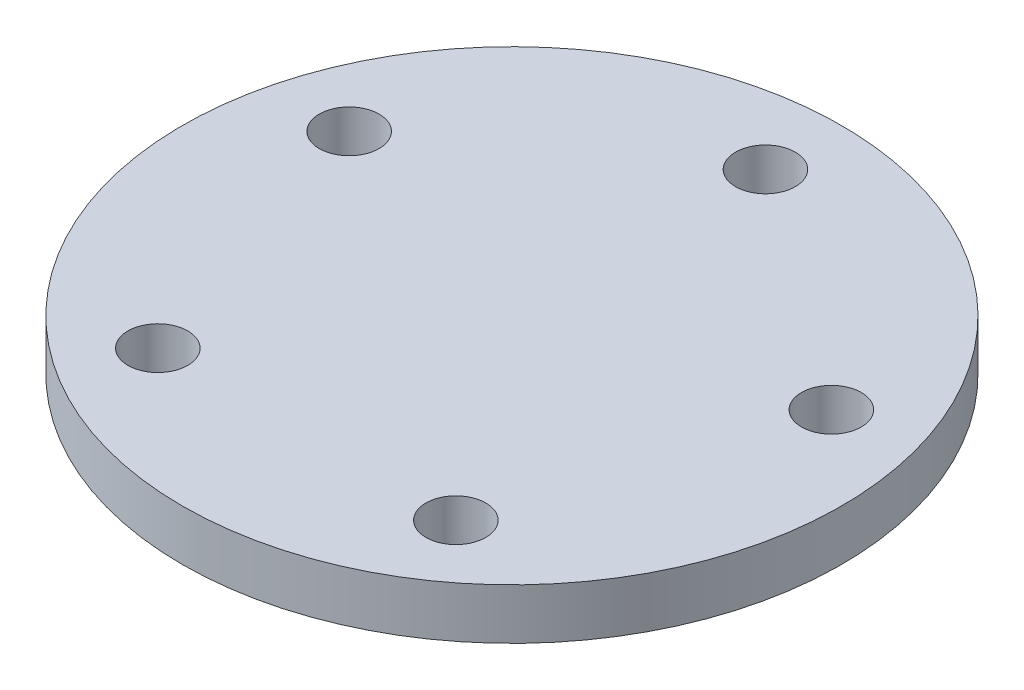
ISO-10303-21;
HEADER;
FILE_DESCRIPTION(('STEP AP214'),'2;1');
FILE_NAME('part.step','',(''),(''),'','','');
FILE_SCHEMA(('AUTOMOTIVE_DESIGN { 1 0 10303 214 1 1 1 1 }'));
ENDSEC;
DATA;
#1=APPLICATION_CONTEXT('core data for automotive mechanical design processes');
#2=APPLICATION_PROTOCOL_DEFINITION('international standard','automotive_design',2000,#1);
#3=PRODUCT_CONTEXT('',#1,'mechanical');
#4=PRODUCT('Part','Part','',(#3));
#5=PRODUCT_RELATED_PRODUCT_CATEGORY('part','',(#4));
#6=PRODUCT_DEFINITION_FORMATION('','',#4);
#7=PRODUCT_DEFINITION_CONTEXT('part definition',#1,'design');
#8=PRODUCT_DEFINITION('design','',#6,#7);
#9=PRODUCT_DEFINITION_SHAPE('','',#8);
#10=(LENGTH_UNIT() NAMED_UNIT(*) SI_UNIT(.MILLI.,.METRE.));
#11=(NAMED_UNIT(*) PLANE_ANGLE_UNIT() SI_UNIT($,.RADIAN.));
#12=(NAMED_UNIT(*) SI_UNIT($,.STERADIAN.) SOLID_ANGLE_UNIT());
#13=UNCERTAINTY_MEASURE_WITH_UNIT(LENGTH_MEASURE(1.E-05),#10,'distance_accuracy_value','');
#14=(GEOMETRIC_REPRESENTATION_CONTEXT(3) GLOBAL_UNCERTAINTY_ASSIGNED_CONTEXT((#13)) GLOBAL_UNIT_ASSIGNED_CONTEXT((#10,
#11,#12)) REPRESENTATION_CONTEXT('',''));
#15=CARTESIAN_POINT('',(0.,0.,0.));
#16=DIRECTION('',(0.,0.,1.));
#17=DIRECTION('',(1.,0.,0.));
#18=AXIS2_PLACEMENT_3D('',#15,#16,#17);
#19=CARTESIAN_POINT('',(0.,10.,0.));
#20=DIRECTION('',(0.,-1.,0.));
#21=DIRECTION('',(0.,0.,-1.));
#22=AXIS2_PLACEMENT_3D('',#19,#20,#21);
#23=CYLINDRICAL_SURFACE('',#22,17.5);
#24=CARTESIAN_POINT('',(0.,10.,0.));
#25=DIRECTION('',(0.,1.,0.));
#26=DIRECTION('',(0.,0.,1.));
#27=AXIS2_PLACEMENT_3D('',#24,#25,#26);
#28=CIRCLE('',#27,17.5);
#29=CARTESIAN_POINT('',(0.,10.,17.5));
#30=VERTEX_POINT('',#29);
#31=EDGE_CURVE('E10',#30,#30,#28,.T.);
#32=ORIENTED_EDGE('',*,*,#31,.F.);
#33=EDGE_LOOP('',(#32));
#34=FACE_BOUND('',#33,.T.);
#35=CARTESIAN_POINT('',(0.,0.,0.));
#36=DIRECTION('',(0.,1.,0.));
#37=DIRECTION('',(0.,0.,1.));
#38=AXIS2_PLACEMENT_3D('',#35,#36,#37);
#39=CIRCLE('',#38,17.5);
#40=CARTESIAN_POINT('',(0.,0.,17.5));
#41=VERTEX_POINT('',#40);
#42=EDGE_CURVE('E51',#41,#41,#39,.T.);
#43=ORIENTED_EDGE('',*,*,#42,.T.);
#44=EDGE_LOOP('',(#43));
#45=FACE_BOUND('',#44,.T.);
#46=ADVANCED_FACE('F43',(#34,#45),#23,.T.);
#47=CARTESIAN_POINT('',(0.,0.,0.));
#48=DIRECTION('',(0.,1.,0.));
#49=DIRECTION('',(0.,0.,1.));
#50=AXIS2_PLACEMENT_3D('',#47,#48,#49);
#51=PLANE('',#50);
#52=ORIENTED_EDGE('',*,*,#42,.F.);
#53=EDGE_LOOP('',(#52));
#54=FACE_BOUND('',#53,.T.);
#55=ADVANCED_FACE('F144',(#54),#51,.F.);
#56=CARTESIAN_POINT('',(0.,15.,0.));
#57=DIRECTION('',(0.,-1.,0.));
#58=DIRECTION('',(0.,0.,-1.));
#59=AXIS2_PLACEMENT_3D('',#56,#57,#58);
#60=CYLINDRICAL_SURFACE('',#59,32.5);
#61=CARTESIAN_POINT('',(0.,15.,0.));
#62=DIRECTION('',(0.,1.,0.));
#63=DIRECTION('',(0.,0.,1.));
#64=AXIS2_PLACEMENT_3D('',#61,#62,#63);
#65=CIRCLE('',#64,32.5);
#66=CARTESIAN_POINT('',(0.,15.,32.5));
#67=VERTEX_POINT('',#66);
#68=EDGE_CURVE('E57',#67,#67,#65,.T.);
#69=ORIENTED_EDGE('',*,*,#68,.F.);
#70=EDGE_LOOP('',(#69));
#71=FACE_BOUND('',#70,.T.);
#72=CARTESIAN_POINT('',(0.,10.,0.));
#73=DIRECTION('',(0.,1.,0.));
#74=DIRECTION('',(0.,0.,1.));
#75=AXIS2_PLACEMENT_3D('',#72,#73,#74);
#76=CIRCLE('',#75,32.5);
#77=CARTESIAN_POINT('',(0.,10.,32.5));
#78=VERTEX_POINT('',#77);
#79=EDGE_CURVE('E60',#78,#78,#76,.T.);
#80=ORIENTED_EDGE('',*,*,#79,.T.);
#81=EDGE_LOOP('',(#80));
#82=FACE_BOUND('',#81,.T.);
#83=ADVANCED_FACE('F120',(#71,#82),#60,.T.);
#84=CARTESIAN_POINT('',(0.,15.,0.));
#85=DIRECTION('',(0.,1.,0.));
#86=DIRECTION('',(0.,0.,1.));
#87=AXIS2_PLACEMENT_3D('',#84,#85,#86);
#88=PLANE('',#87);
#89=CARTESIAN_POINT('',(0.,15.,-25.));
#90=DIRECTION('',(0.,1.,0.));
#91=DIRECTION('',(0.,0.,1.));
#92=AXIS2_PLACEMENT_3D('',#89,#90,#91);
#93=CIRCLE('',#92,2.95);
#94=CARTESIAN_POINT('',(0.,15.,-22.05));
#95=VERTEX_POINT('',#94);
#96=EDGE_CURVE('E68',#95,#95,#93,.T.);
#97=ORIENTED_EDGE('',*,*,#96,.F.);
#98=EDGE_LOOP('',(#97));
#99=FACE_BOUND('',#98,.T.);
#100=CARTESIAN_POINT('',(23.7764129073789,15.,-7.72542485937362));
#101=DIRECTION('',(0.,1.,0.));
#102=DIRECTION('',(0.,0.,1.));
#103=AXIS2_PLACEMENT_3D('',#100,#101,#102);
#104=CIRCLE('',#103,2.95);
#105=CARTESIAN_POINT('',(23.7764129073789,15.,-4.77542485937362));
#106=VERTEX_POINT('',#105);
#107=EDGE_CURVE('E105',#106,#106,#104,.T.);
#108=ORIENTED_EDGE('',*,*,#107,.F.);
#109=EDGE_LOOP('',(#108));
#110=FACE_BOUND('',#109,.T.);
#111=CARTESIAN_POINT('',(14.6946313073117,15.,20.2254248593738));
#112=DIRECTION('',(0.,1.,0.));
#113=DIRECTION('',(0.,0.,1.));
#114=AXIS2_PLACEMENT_3D('',#111,#112,#113);
#115=CIRCLE('',#114,2.95);
#116=CARTESIAN_POINT('',(14.6946313073117,15.,23.1754248593738));
#117=VERTEX_POINT('',#116);
#118=EDGE_CURVE('E101',#117,#117,#115,.T.);
#119=ORIENTED_EDGE('',*,*,#118,.F.);
#120=EDGE_LOOP('',(#119));
#121=FACE_BOUND('',#120,.T.);
#122=CARTESIAN_POINT('',(-14.694631307312,15.,20.2254248593736));
#123=DIRECTION('',(0.,1.,0.));
#124=DIRECTION('',(0.,0.,1.));
#125=AXIS2_PLACEMENT_3D('',#122,#123,#124);
#126=CIRCLE('',#125,2.95);
#127=CARTESIAN_POINT('',(-14.694631307312,15.,23.1754248593736));
#128=VERTEX_POINT('',#127);
#129=EDGE_CURVE('E97',#128,#128,#126,.T.);
#130=ORIENTED_EDGE('',*,*,#129,.F.);
#131=EDGE_LOOP('',(#130));
#132=FACE_BOUND('',#131,.T.);
#133=CARTESIAN_POINT('',(-23.7764129073788,15.,-7.72542485937396));
#134=DIRECTION('',(0.,1.,0.));
#135=DIRECTION('',(0.,0.,1.));
#136=AXIS2_PLACEMENT_3D('',#133,#134,#135);
#137=CIRCLE('',#136,2.95);
#138=CARTESIAN_POINT('',(-23.7764129073788,15.,-4.77542485937395));
#139=VERTEX_POINT('',#138);
#140=EDGE_CURVE('E93',#139,#139,#137,.T.);
#141=ORIENTED_EDGE('',*,*,#140,.F.);
#142=EDGE_LOOP('',(#141));
#143=FACE_BOUND('',#142,.T.);
#144=ORIENTED_EDGE('',*,*,#68,.T.);
#145=EDGE_LOOP('',(#144));
#146=FACE_BOUND('',#145,.T.);
#147=ADVANCED_FACE('F116',(#99,#110,#121,#132,#143,#146),#88,.T.);
#148=CARTESIAN_POINT('',(0.,10.,0.));
#149=DIRECTION('',(0.,1.,0.));
#150=DIRECTION('',(0.,0.,1.));
#151=AXIS2_PLACEMENT_3D('',#148,#149,#150);
#152=PLANE('',#151);
#153=CARTESIAN_POINT('',(0.,10.,-25.));
#154=DIRECTION('',(0.,1.,0.));
#155=DIRECTION('',(0.,0.,1.));
#156=AXIS2_PLACEMENT_3D('',#153,#154,#155);
#157=CIRCLE('',#156,2.95);
#158=CARTESIAN_POINT('',(0.,10.,-22.05));
#159=VERTEX_POINT('',#158);
#160=EDGE_CURVE('E46',#159,#159,#157,.T.);
#161=ORIENTED_EDGE('',*,*,#160,.T.);
#162=EDGE_LOOP('',(#161));
#163=FACE_BOUND('',#162,.T.);
#164=CARTESIAN_POINT('',(23.7764129073789,10.,-7.72542485937362));
#165=DIRECTION('',(0.,1.,0.));
#166=DIRECTION('',(0.,0.,1.));
#167=AXIS2_PLACEMENT_3D('',#164,#165,#166);
#168=CIRCLE('',#167,2.95);
#169=CARTESIAN_POINT('',(23.7764129073789,10.,-4.77542485937362));
#170=VERTEX_POINT('',#169);
#171=EDGE_CURVE('E75',#170,#170,#168,.T.);
#172=ORIENTED_EDGE('',*,*,#171,.T.);
#173=EDGE_LOOP('',(#172));
#174=FACE_BOUND('',#173,.T.);
#175=CARTESIAN_POINT('',(14.6946313073117,10.,20.2254248593738));
#176=DIRECTION('',(0.,1.,0.));
#177=DIRECTION('',(0.,0.,1.));
#178=AXIS2_PLACEMENT_3D('',#175,#176,#177);
#179=CIRCLE('',#178,2.95);
#180=CARTESIAN_POINT('',(14.6946313073117,10.,23.1754248593738));
#181=VERTEX_POINT('',#180);
#182=EDGE_CURVE('E72',#181,#181,#179,.T.);
#183=ORIENTED_EDGE('',*,*,#182,.T.);
#184=EDGE_LOOP('',(#183));
#185=FACE_BOUND('',#184,.T.);
#186=CARTESIAN_POINT('',(-14.694631307312,10.,20.2254248593736));
#187=DIRECTION('',(0.,1.,0.));
#188=DIRECTION('',(0.,0.,1.));
#189=AXIS2_PLACEMENT_3D('',#186,#187,#188);
#190=CIRCLE('',#189,2.95);
#191=CARTESIAN_POINT('',(-14.694631307312,10.,23.1754248593736));
#192=VERTEX_POINT('',#191);
#193=EDGE_CURVE('E67',#192,#192,#190,.T.);
#194=ORIENTED_EDGE('',*,*,#193,.T.);
#195=EDGE_LOOP('',(#194));
#196=FACE_BOUND('',#195,.T.);
#197=CARTESIAN_POINT('',(-23.7764129073788,10.,-7.72542485937396));
#198=DIRECTION('',(0.,1.,0.));
#199=DIRECTION('',(0.,0.,1.));
#200=AXIS2_PLACEMENT_3D('',#197,#198,#199);
#201=CIRCLE('',#200,2.95);
#202=CARTESIAN_POINT('',(-23.7764129073788,10.,-4.77542485937395));
#203=VERTEX_POINT('',#202);
#204=EDGE_CURVE('E63',#203,#203,#201,.T.);
#205=ORIENTED_EDGE('',*,*,#204,.T.);
#206=EDGE_LOOP('',(#205));
#207=FACE_BOUND('',#206,.T.);
#208=ORIENTED_EDGE('',*,*,#31,.T.);
#209=EDGE_LOOP('',(#208));
#210=FACE_BOUND('',#209,.T.);
#211=ORIENTED_EDGE('',*,*,#79,.F.);
#212=EDGE_LOOP('',(#211));
#213=FACE_BOUND('',#212,.T.);
#214=ADVANCED_FACE('F119',(#163,#174,#185,#196,#207,#210,#213),#152,.F.);
#215=CARTESIAN_POINT('',(-23.7764129073788,8.,-7.72542485937396));
#216=DIRECTION('',(0.,1.,0.));
#217=DIRECTION('',(0.,0.,1.));
#218=AXIS2_PLACEMENT_3D('',#215,#216,#217);
#219=CYLINDRICAL_SURFACE('',#218,2.95);
#220=ORIENTED_EDGE('',*,*,#140,.T.);
#221=EDGE_LOOP('',(#220));
#222=FACE_BOUND('',#221,.T.);
#223=ORIENTED_EDGE('',*,*,#204,.F.);
#224=EDGE_LOOP('',(#223));
#225=FACE_BOUND('',#224,.T.);
#226=ADVANCED_FACE('F130',(#222,#225),#219,.F.);
#227=CARTESIAN_POINT('',(-14.694631307312,8.,20.2254248593736));
#228=DIRECTION('',(0.,1.,0.));
#229=DIRECTION('',(0.,0.,1.));
#230=AXIS2_PLACEMENT_3D('',#227,#228,#229);
#231=CYLINDRICAL_SURFACE('',#230,2.95);
#232=ORIENTED_EDGE('',*,*,#129,.T.);
#233=EDGE_LOOP('',(#232));
#234=FACE_BOUND('',#233,.T.);
#235=ORIENTED_EDGE('',*,*,#193,.F.);
#236=EDGE_LOOP('',(#235));
#237=FACE_BOUND('',#236,.T.);
#238=ADVANCED_FACE('F133',(#234,#237),#231,.F.);
#239=CARTESIAN_POINT('',(14.6946313073117,8.,20.2254248593738));
#240=DIRECTION('',(0.,1.,0.));
#241=DIRECTION('',(0.,0.,1.));
#242=AXIS2_PLACEMENT_3D('',#239,#240,#241);
#243=CYLINDRICAL_SURFACE('',#242,2.95);
#244=ORIENTED_EDGE('',*,*,#118,.T.);
#245=EDGE_LOOP('',(#244));
#246=FACE_BOUND('',#245,.T.);
#247=ORIENTED_EDGE('',*,*,#182,.F.);
#248=EDGE_LOOP('',(#247));
#249=FACE_BOUND('',#248,.T.);
#250=ADVANCED_FACE('F183',(#246,#249),#243,.F.);
#251=CARTESIAN_POINT('',(23.7764129073789,8.,-7.72542485937362));
#252=DIRECTION('',(0.,1.,0.));
#253=DIRECTION('',(0.,0.,1.));
#254=AXIS2_PLACEMENT_3D('',#251,#252,#253);
#255=CYLINDRICAL_SURFACE('',#254,2.95);
#256=ORIENTED_EDGE('',*,*,#107,.T.);
#257=EDGE_LOOP('',(#256));
#258=FACE_BOUND('',#257,.T.);
#259=ORIENTED_EDGE('',*,*,#171,.F.);
#260=EDGE_LOOP('',(#259));
#261=FACE_BOUND('',#260,.T.);
#262=ADVANCED_FACE('F193',(#258,#261),#255,.F.);
#263=CARTESIAN_POINT('',(0.,8.,-25.));
#264=DIRECTION('',(0.,1.,0.));
#265=DIRECTION('',(0.,0.,1.));
#266=AXIS2_PLACEMENT_3D('',#263,#264,#265);
#267=CYLINDRICAL_SURFACE('',#266,2.95);
#268=ORIENTED_EDGE('',*,*,#96,.T.);
#269=EDGE_LOOP('',(#268));
#270=FACE_BOUND('',#269,.T.);
#271=ORIENTED_EDGE('',*,*,#160,.F.);
#272=EDGE_LOOP('',(#271));
#273=FACE_BOUND('',#272,.T.);
#274=ADVANCED_FACE('F113',(#270,#273),#267,.F.);
#275=CLOSED_SHELL('',(#46,#55,#83,#147,#214,#226,#238,#250,#262,#274));
#276=MANIFOLD_SOLID_BREP('B2',#275);
#277=ADVANCED_BREP_SHAPE_REPRESENTATION('',(#18,#276),#14);
#278=SHAPE_DEFINITION_REPRESENTATION(#9,#277);
ENDSEC;
END-ISO-10303-21;
